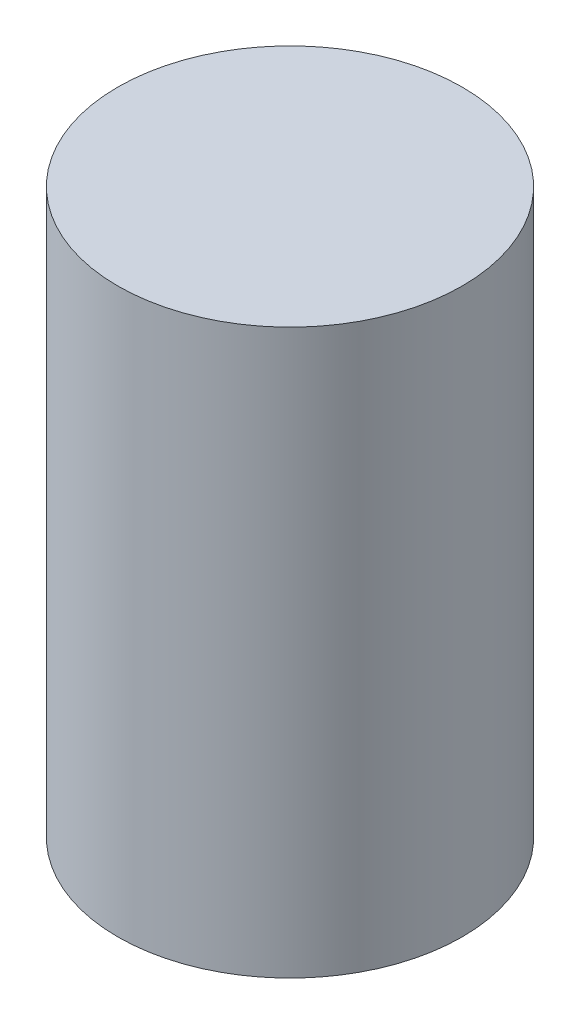
ISO-10303-21;
HEADER;
FILE_DESCRIPTION(('STEP AP214'),'2;1');
FILE_NAME('part.step','',(''),(''),'','','');
FILE_SCHEMA(('AUTOMOTIVE_DESIGN { 1 0 10303 214 1 1 1 1 }'));
ENDSEC;
DATA;
#1=APPLICATION_CONTEXT('core data for automotive mechanical design processes');
#2=APPLICATION_PROTOCOL_DEFINITION('international standard','automotive_design',2000,#1);
#3=PRODUCT_CONTEXT('',#1,'mechanical');
#4=PRODUCT('Part','Part','',(#3));
#5=PRODUCT_RELATED_PRODUCT_CATEGORY('part','',(#4));
#6=PRODUCT_DEFINITION_FORMATION('','',#4);
#7=PRODUCT_DEFINITION_CONTEXT('part definition',#1,'design');
#8=PRODUCT_DEFINITION('design','',#6,#7);
#9=PRODUCT_DEFINITION_SHAPE('','',#8);
#10=(LENGTH_UNIT() NAMED_UNIT(*) SI_UNIT(.MILLI.,.METRE.));
#11=(NAMED_UNIT(*) PLANE_ANGLE_UNIT() SI_UNIT($,.RADIAN.));
#12=(NAMED_UNIT(*) SI_UNIT($,.STERADIAN.) SOLID_ANGLE_UNIT());
#13=UNCERTAINTY_MEASURE_WITH_UNIT(LENGTH_MEASURE(1.E-05),#10,'distance_accuracy_value','');
#14=(GEOMETRIC_REPRESENTATION_CONTEXT(3) GLOBAL_UNCERTAINTY_ASSIGNED_CONTEXT((#13)) GLOBAL_UNIT_ASSIGNED_CONTEXT((#10,
#11,#12)) REPRESENTATION_CONTEXT('',''));
#15=CARTESIAN_POINT('',(0.,0.,0.));
#16=DIRECTION('',(0.,0.,1.));
#17=DIRECTION('',(1.,0.,0.));
#18=AXIS2_PLACEMENT_3D('',#15,#16,#17);
#19=CARTESIAN_POINT('',(0.,18.,0.));
#20=DIRECTION('',(0.,-1.,0.));
#21=DIRECTION('',(0.,0.,-1.));
#22=AXIS2_PLACEMENT_3D('',#19,#20,#21);
#23=CYLINDRICAL_SURFACE('',#22,5.5);
#24=CARTESIAN_POINT('',(0.,18.,0.));
#25=DIRECTION('',(0.,1.,0.));
#26=DIRECTION('',(0.,0.,1.));
#27=AXIS2_PLACEMENT_3D('',#24,#25,#26);
#28=CIRCLE('',#27,5.5);
#29=CARTESIAN_POINT('',(0.,18.,5.5));
#30=VERTEX_POINT('',#29);
#31=EDGE_CURVE('E10',#30,#30,#28,.T.);
#32=ORIENTED_EDGE('',*,*,#31,.F.);
#33=EDGE_LOOP('',(#32));
#34=FACE_BOUND('',#33,.T.);
#35=CARTESIAN_POINT('',(0.,0.,0.));
#36=DIRECTION('',(0.,1.,0.));
#37=DIRECTION('',(0.,0.,1.));
#38=AXIS2_PLACEMENT_3D('',#35,#36,#37);
#39=CIRCLE('',#38,5.5);
#40=CARTESIAN_POINT('',(0.,0.,5.5));
#41=VERTEX_POINT('',#40);
#42=EDGE_CURVE('E34',#41,#41,#39,.T.);
#43=ORIENTED_EDGE('',*,*,#42,.T.);
#44=EDGE_LOOP('',(#43));
#45=FACE_BOUND('',#44,.T.);
#46=ADVANCED_FACE('F31',(#34,#45),#23,.T.);
#47=CARTESIAN_POINT('',(0.,18.,0.));
#48=DIRECTION('',(0.,1.,0.));
#49=DIRECTION('',(0.,0.,1.));
#50=AXIS2_PLACEMENT_3D('',#47,#48,#49);
#51=PLANE('',#50);
#52=ORIENTED_EDGE('',*,*,#31,.T.);
#53=EDGE_LOOP('',(#52));
#54=FACE_BOUND('',#53,.T.);
#55=ADVANCED_FACE('F46',(#54),#51,.T.);
#56=CARTESIAN_POINT('',(0.,0.,0.));
#57=DIRECTION('',(0.,1.,0.));
#58=DIRECTION('',(0.,0.,1.));
#59=AXIS2_PLACEMENT_3D('',#56,#57,#58);
#60=PLANE('',#59);
#61=ORIENTED_EDGE('',*,*,#42,.F.);
#62=EDGE_LOOP('',(#61));
#63=FACE_BOUND('',#62,.T.);
#64=ADVANCED_FACE('F44',(#63),#60,.F.);
#65=CLOSED_SHELL('',(#46,#55,#64));
#66=MANIFOLD_SOLID_BREP('B2',#65);
#67=ADVANCED_BREP_SHAPE_REPRESENTATION('',(#18,#66),#14);
#68=SHAPE_DEFINITION_REPRESENTATION(#9,#67);
ENDSEC;
END-ISO-10303-21;
